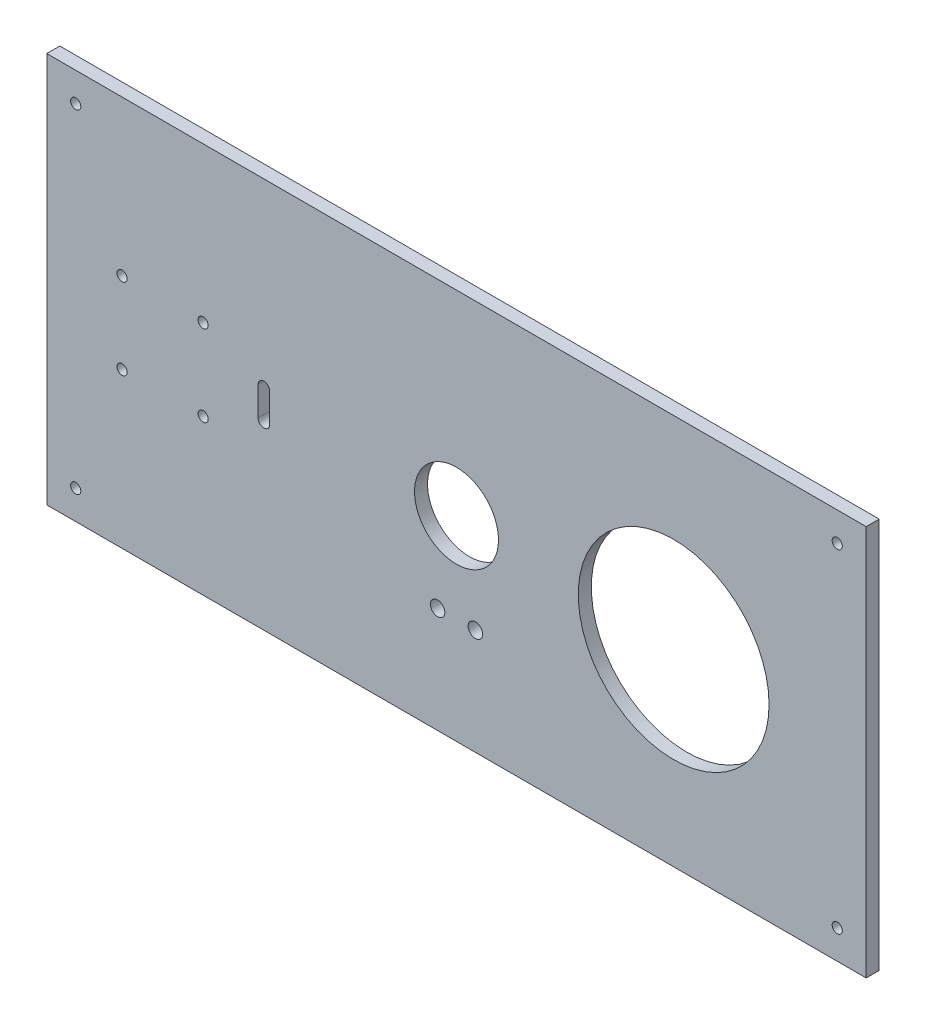
ISO-10303-21;
HEADER;
FILE_DESCRIPTION(('STEP AP214'),'2;1');
FILE_NAME('part.step','',(''),(''),'','','');
FILE_SCHEMA(('AUTOMOTIVE_DESIGN { 1 0 10303 214 1 1 1 1 }'));
ENDSEC;
DATA;
#1=APPLICATION_CONTEXT('core data for automotive mechanical design processes');
#2=APPLICATION_PROTOCOL_DEFINITION('international standard','automotive_design',2000,#1);
#3=PRODUCT_CONTEXT('',#1,'mechanical');
#4=PRODUCT('Part','Part','',(#3));
#5=PRODUCT_RELATED_PRODUCT_CATEGORY('part','',(#4));
#6=PRODUCT_DEFINITION_FORMATION('','',#4);
#7=PRODUCT_DEFINITION_CONTEXT('part definition',#1,'design');
#8=PRODUCT_DEFINITION('design','',#6,#7);
#9=PRODUCT_DEFINITION_SHAPE('','',#8);
#10=(LENGTH_UNIT() NAMED_UNIT(*) SI_UNIT(.MILLI.,.METRE.));
#11=(NAMED_UNIT(*) PLANE_ANGLE_UNIT() SI_UNIT($,.RADIAN.));
#12=(NAMED_UNIT(*) SI_UNIT($,.STERADIAN.) SOLID_ANGLE_UNIT());
#13=UNCERTAINTY_MEASURE_WITH_UNIT(LENGTH_MEASURE(1.E-05),#10,'distance_accuracy_value','');
#14=(GEOMETRIC_REPRESENTATION_CONTEXT(3) GLOBAL_UNCERTAINTY_ASSIGNED_CONTEXT((#13)) GLOBAL_UNIT_ASSIGNED_CONTEXT((#10,
#11,#12)) REPRESENTATION_CONTEXT('',''));
#15=CARTESIAN_POINT('',(0.,0.,0.));
#16=DIRECTION('',(0.,0.,1.));
#17=DIRECTION('',(1.,0.,0.));
#18=AXIS2_PLACEMENT_3D('',#15,#16,#17);
#19=CARTESIAN_POINT('',(-141.5,0.,4.5));
#20=DIRECTION('',(-1.,0.,0.));
#21=DIRECTION('',(0.,0.,1.));
#22=AXIS2_PLACEMENT_3D('',#19,#20,#21);
#23=PLANE('',#22);
#24=DIRECTION('',(0.,1.,0.));
#25=VECTOR('',#24,1.);
#26=CARTESIAN_POINT('',(-141.5,0.,0.));
#27=LINE('',#26,#25);
#28=CARTESIAN_POINT('',(-141.5,-67.5,0.));
#29=VERTEX_POINT('',#28);
#30=CARTESIAN_POINT('',(-141.5,67.5,0.));
#31=VERTEX_POINT('',#30);
#32=EDGE_CURVE('E210',#29,#31,#27,.T.);
#33=ORIENTED_EDGE('',*,*,#32,.F.);
#34=DIRECTION('',(0.,0.,-1.));
#35=VECTOR('',#34,1.);
#36=CARTESIAN_POINT('',(-141.5,-67.5,4.5));
#37=LINE('',#36,#35);
#38=CARTESIAN_POINT('',(-141.5,-67.5,4.5));
#39=VERTEX_POINT('',#38);
#40=EDGE_CURVE('E11',#39,#29,#37,.T.);
#41=ORIENTED_EDGE('',*,*,#40,.F.);
#42=DIRECTION('',(0.,1.,0.));
#43=VECTOR('',#42,1.);
#44=CARTESIAN_POINT('',(-141.5,0.,4.5));
#45=LINE('',#44,#43);
#46=CARTESIAN_POINT('',(-141.5,67.5,4.5));
#47=VERTEX_POINT('',#46);
#48=EDGE_CURVE('E211',#39,#47,#45,.T.);
#49=ORIENTED_EDGE('',*,*,#48,.T.);
#50=DIRECTION('',(0.,0.,-1.));
#51=VECTOR('',#50,1.);
#52=CARTESIAN_POINT('',(-141.5,67.5,4.5));
#53=LINE('',#52,#51);
#54=EDGE_CURVE('E226',#47,#31,#53,.T.);
#55=ORIENTED_EDGE('',*,*,#54,.T.);
#56=EDGE_LOOP('',(#33,#41,#49,#55));
#57=FACE_BOUND('',#56,.T.);
#58=ADVANCED_FACE('F40',(#57),#23,.T.);
#59=CARTESIAN_POINT('',(0.,-67.5,4.5));
#60=DIRECTION('',(0.,-1.,0.));
#61=DIRECTION('',(1.,0.,0.));
#62=AXIS2_PLACEMENT_3D('',#59,#60,#61);
#63=PLANE('',#62);
#64=DIRECTION('',(-1.,0.,0.));
#65=VECTOR('',#64,1.);
#66=CARTESIAN_POINT('',(0.,-67.5,0.));
#67=LINE('',#66,#65);
#68=CARTESIAN_POINT('',(141.5,-67.5,0.));
#69=VERTEX_POINT('',#68);
#70=EDGE_CURVE('E230',#69,#29,#67,.T.);
#71=ORIENTED_EDGE('',*,*,#70,.F.);
#72=DIRECTION('',(0.,0.,-1.));
#73=VECTOR('',#72,1.);
#74=CARTESIAN_POINT('',(141.5,-67.5,4.5));
#75=LINE('',#74,#73);
#76=CARTESIAN_POINT('',(141.5,-67.5,4.5));
#77=VERTEX_POINT('',#76);
#78=EDGE_CURVE('E48',#77,#69,#75,.T.);
#79=ORIENTED_EDGE('',*,*,#78,.F.);
#80=DIRECTION('',(-1.,0.,0.));
#81=VECTOR('',#80,1.);
#82=CARTESIAN_POINT('',(0.,-67.5,4.5));
#83=LINE('',#82,#81);
#84=EDGE_CURVE('E215',#77,#39,#83,.T.);
#85=ORIENTED_EDGE('',*,*,#84,.T.);
#86=ORIENTED_EDGE('',*,*,#40,.T.);
#87=EDGE_LOOP('',(#71,#79,#85,#86));
#88=FACE_BOUND('',#87,.T.);
#89=ADVANCED_FACE('F256',(#88),#63,.T.);
#90=CARTESIAN_POINT('',(141.5,0.,4.5));
#91=DIRECTION('',(-1.,0.,0.));
#92=DIRECTION('',(0.,0.,1.));
#93=AXIS2_PLACEMENT_3D('',#90,#91,#92);
#94=PLANE('',#93);
#95=DIRECTION('',(0.,1.,0.));
#96=VECTOR('',#95,1.);
#97=CARTESIAN_POINT('',(141.5,0.,0.));
#98=LINE('',#97,#96);
#99=CARTESIAN_POINT('',(141.5,67.5,0.));
#100=VERTEX_POINT('',#99);
#101=EDGE_CURVE('E234',#69,#100,#98,.T.);
#102=ORIENTED_EDGE('',*,*,#101,.T.);
#103=DIRECTION('',(0.,0.,-1.));
#104=VECTOR('',#103,1.);
#105=CARTESIAN_POINT('',(141.5,67.5,4.5));
#106=LINE('',#105,#104);
#107=CARTESIAN_POINT('',(141.5,67.5,4.5));
#108=VERTEX_POINT('',#107);
#109=EDGE_CURVE('E242',#108,#100,#106,.T.);
#110=ORIENTED_EDGE('',*,*,#109,.F.);
#111=DIRECTION('',(0.,1.,0.));
#112=VECTOR('',#111,1.);
#113=CARTESIAN_POINT('',(141.5,0.,4.5));
#114=LINE('',#113,#112);
#115=EDGE_CURVE('E220',#77,#108,#114,.T.);
#116=ORIENTED_EDGE('',*,*,#115,.F.);
#117=ORIENTED_EDGE('',*,*,#78,.T.);
#118=EDGE_LOOP('',(#102,#110,#116,#117));
#119=FACE_BOUND('',#118,.T.);
#120=ADVANCED_FACE('F249',(#119),#94,.F.);
#121=CARTESIAN_POINT('',(0.,67.5,4.5));
#122=DIRECTION('',(0.,-1.,0.));
#123=DIRECTION('',(1.,0.,0.));
#124=AXIS2_PLACEMENT_3D('',#121,#122,#123);
#125=PLANE('',#124);
#126=DIRECTION('',(-1.,0.,0.));
#127=VECTOR('',#126,1.);
#128=CARTESIAN_POINT('',(0.,67.5,0.));
#129=LINE('',#128,#127);
#130=EDGE_CURVE('E216',#100,#31,#129,.T.);
#131=ORIENTED_EDGE('',*,*,#130,.T.);
#132=ORIENTED_EDGE('',*,*,#54,.F.);
#133=DIRECTION('',(-1.,0.,0.));
#134=VECTOR('',#133,1.);
#135=CARTESIAN_POINT('',(0.,67.5,4.5));
#136=LINE('',#135,#134);
#137=EDGE_CURVE('E223',#108,#47,#136,.T.);
#138=ORIENTED_EDGE('',*,*,#137,.F.);
#139=ORIENTED_EDGE('',*,*,#109,.T.);
#140=EDGE_LOOP('',(#131,#132,#138,#139));
#141=FACE_BOUND('',#140,.T.);
#142=ADVANCED_FACE('F263',(#141),#125,.F.);
#143=CARTESIAN_POINT('',(0.,0.,4.5));
#144=DIRECTION('',(0.,0.,1.));
#145=DIRECTION('',(1.,0.,0.));
#146=AXIS2_PLACEMENT_3D('',#143,#144,#145);
#147=PLANE('',#146);
#148=CARTESIAN_POINT('',(75.,-2.49999999999997,4.5));
#149=DIRECTION('',(0.,0.,1.));
#150=DIRECTION('',(1.,0.,0.));
#151=AXIS2_PLACEMENT_3D('',#148,#149,#150);
#152=CIRCLE('',#151,32.95);
#153=CARTESIAN_POINT('',(107.95,-2.49999999999997,4.5));
#154=VERTEX_POINT('',#153);
#155=EDGE_CURVE('E461',#154,#154,#152,.T.);
#156=ORIENTED_EDGE('',*,*,#155,.F.);
#157=EDGE_LOOP('',(#156));
#158=FACE_BOUND('',#157,.T.);
#159=CARTESIAN_POINT('',(6.525,-30.95,4.5));
#160=DIRECTION('',(0.,0.,1.));
#161=DIRECTION('',(1.,0.,0.));
#162=AXIS2_PLACEMENT_3D('',#159,#160,#161);
#163=CIRCLE('',#162,2.5);
#164=CARTESIAN_POINT('',(9.025,-30.95,4.5));
#165=VERTEX_POINT('',#164);
#166=EDGE_CURVE('E470',#165,#165,#163,.T.);
#167=ORIENTED_EDGE('',*,*,#166,.F.);
#168=EDGE_LOOP('',(#167));
#169=FACE_BOUND('',#168,.T.);
#170=CARTESIAN_POINT('',(-6.525,-30.95,4.5));
#171=DIRECTION('',(0.,0.,1.));
#172=DIRECTION('',(1.,0.,0.));
#173=AXIS2_PLACEMENT_3D('',#170,#171,#172);
#174=CIRCLE('',#173,2.5);
#175=CARTESIAN_POINT('',(-4.025,-30.95,4.5));
#176=VERTEX_POINT('',#175);
#177=EDGE_CURVE('E478',#176,#176,#174,.T.);
#178=ORIENTED_EDGE('',*,*,#177,.F.);
#179=EDGE_LOOP('',(#178));
#180=FACE_BOUND('',#179,.T.);
#181=CARTESIAN_POINT('',(0.,0.,4.5));
#182=DIRECTION('',(0.,0.,1.));
#183=DIRECTION('',(1.,0.,0.));
#184=AXIS2_PLACEMENT_3D('',#181,#182,#183);
#185=CIRCLE('',#184,14.5);
#186=CARTESIAN_POINT('',(14.5,0.,4.5));
#187=VERTEX_POINT('',#186);
#188=EDGE_CURVE('E479',#187,#187,#185,.T.);
#189=ORIENTED_EDGE('',*,*,#188,.F.);
#190=EDGE_LOOP('',(#189));
#191=FACE_BOUND('',#190,.T.);
#192=CARTESIAN_POINT('',(-87.5,14.,4.5));
#193=DIRECTION('',(0.,0.,1.));
#194=DIRECTION('',(1.,0.,0.));
#195=AXIS2_PLACEMENT_3D('',#192,#193,#194);
#196=CIRCLE('',#195,1.74999999999998);
#197=CARTESIAN_POINT('',(-85.75,14.,4.5));
#198=VERTEX_POINT('',#197);
#199=EDGE_CURVE('E161',#198,#198,#196,.T.);
#200=ORIENTED_EDGE('',*,*,#199,.F.);
#201=EDGE_LOOP('',(#200));
#202=FACE_BOUND('',#201,.T.);
#203=CARTESIAN_POINT('',(-115.5,14.,4.5));
#204=DIRECTION('',(0.,0.,1.));
#205=DIRECTION('',(1.,0.,0.));
#206=AXIS2_PLACEMENT_3D('',#203,#204,#205);
#207=CIRCLE('',#206,1.74999999999997);
#208=CARTESIAN_POINT('',(-113.75,14.,4.5));
#209=VERTEX_POINT('',#208);
#210=EDGE_CURVE('E152',#209,#209,#207,.T.);
#211=ORIENTED_EDGE('',*,*,#210,.F.);
#212=EDGE_LOOP('',(#211));
#213=FACE_BOUND('',#212,.T.);
#214=CARTESIAN_POINT('',(-66.5,-5.00000000000001,4.5));
#215=DIRECTION('',(0.,0.,1.));
#216=DIRECTION('',(1.,0.,0.));
#217=AXIS2_PLACEMENT_3D('',#214,#215,#216);
#218=CIRCLE('',#217,1.99999999999999);
#219=CARTESIAN_POINT('',(-68.5,-5.00000000000001,4.5));
#220=VERTEX_POINT('',#219);
#221=CARTESIAN_POINT('',(-64.5,-5.00000000000001,4.5));
#222=VERTEX_POINT('',#221);
#223=EDGE_CURVE('E55',#220,#222,#218,.T.);
#224=ORIENTED_EDGE('',*,*,#223,.F.);
#225=DIRECTION('',(0.,-1.,0.));
#226=VECTOR('',#225,1.);
#227=CARTESIAN_POINT('',(-68.5,-5.00000000000001,4.5));
#228=LINE('',#227,#226);
#229=CARTESIAN_POINT('',(-68.5,4.99999999999999,4.5));
#230=VERTEX_POINT('',#229);
#231=EDGE_CURVE('E113',#230,#220,#228,.T.);
#232=ORIENTED_EDGE('',*,*,#231,.F.);
#233=CARTESIAN_POINT('',(-66.5,4.99999999999999,4.5));
#234=DIRECTION('',(0.,0.,1.));
#235=DIRECTION('',(1.,0.,0.));
#236=AXIS2_PLACEMENT_3D('',#233,#234,#235);
#237=CIRCLE('',#236,1.99999999999999);
#238=CARTESIAN_POINT('',(-64.5,4.99999999999999,4.5));
#239=VERTEX_POINT('',#238);
#240=EDGE_CURVE('E138',#239,#230,#237,.T.);
#241=ORIENTED_EDGE('',*,*,#240,.F.);
#242=DIRECTION('',(0.,1.,0.));
#243=VECTOR('',#242,1.);
#244=CARTESIAN_POINT('',(-64.5,-5.00000000000001,4.5));
#245=LINE('',#244,#243);
#246=EDGE_CURVE('E131',#222,#239,#245,.T.);
#247=ORIENTED_EDGE('',*,*,#246,.F.);
#248=EDGE_LOOP('',(#224,#232,#241,#247));
#249=FACE_BOUND('',#248,.T.);
#250=CARTESIAN_POINT('',(-115.5,-14.,4.5));
#251=DIRECTION('',(0.,0.,1.));
#252=DIRECTION('',(1.,0.,0.));
#253=AXIS2_PLACEMENT_3D('',#250,#251,#252);
#254=CIRCLE('',#253,1.74999999999998);
#255=CARTESIAN_POINT('',(-113.75,-14.,4.5));
#256=VERTEX_POINT('',#255);
#257=EDGE_CURVE('E120',#256,#256,#254,.T.);
#258=ORIENTED_EDGE('',*,*,#257,.F.);
#259=EDGE_LOOP('',(#258));
#260=FACE_BOUND('',#259,.T.);
#261=CARTESIAN_POINT('',(-87.5,-14.,4.5));
#262=DIRECTION('',(0.,0.,1.));
#263=DIRECTION('',(1.,0.,0.));
#264=AXIS2_PLACEMENT_3D('',#261,#262,#263);
#265=CIRCLE('',#264,1.74999999999991);
#266=CARTESIAN_POINT('',(-85.7500000000001,-14.,4.5));
#267=VERTEX_POINT('',#266);
#268=EDGE_CURVE('E169',#267,#267,#265,.T.);
#269=ORIENTED_EDGE('',*,*,#268,.F.);
#270=EDGE_LOOP('',(#269));
#271=FACE_BOUND('',#270,.T.);
#272=CARTESIAN_POINT('',(131.5,57.5,4.5));
#273=DIRECTION('',(0.,0.,1.));
#274=DIRECTION('',(1.,0.,0.));
#275=AXIS2_PLACEMENT_3D('',#272,#273,#274);
#276=CIRCLE('',#275,1.75000000000001);
#277=CARTESIAN_POINT('',(133.25,57.5,4.5));
#278=VERTEX_POINT('',#277);
#279=EDGE_CURVE('E178',#278,#278,#276,.F.);
#280=ORIENTED_EDGE('',*,*,#279,.T.);
#281=EDGE_LOOP('',(#280));
#282=FACE_BOUND('',#281,.T.);
#283=CARTESIAN_POINT('',(131.5,-57.5,4.5));
#284=DIRECTION('',(0.,0.,1.));
#285=DIRECTION('',(1.,0.,0.));
#286=AXIS2_PLACEMENT_3D('',#283,#284,#285);
#287=CIRCLE('',#286,1.75000000000001);
#288=CARTESIAN_POINT('',(133.25,-57.5,4.5));
#289=VERTEX_POINT('',#288);
#290=EDGE_CURVE('E190',#289,#289,#287,.T.);
#291=ORIENTED_EDGE('',*,*,#290,.F.);
#292=EDGE_LOOP('',(#291));
#293=FACE_BOUND('',#292,.T.);
#294=CARTESIAN_POINT('',(-131.5,-57.5,4.5));
#295=DIRECTION('',(0.,0.,1.));
#296=DIRECTION('',(1.,0.,0.));
#297=AXIS2_PLACEMENT_3D('',#294,#295,#296);
#298=CIRCLE('',#297,1.75000000000001);
#299=CARTESIAN_POINT('',(-129.75,-57.5,4.5));
#300=VERTEX_POINT('',#299);
#301=EDGE_CURVE('E194',#300,#300,#298,.F.);
#302=ORIENTED_EDGE('',*,*,#301,.T.);
#303=EDGE_LOOP('',(#302));
#304=FACE_BOUND('',#303,.T.);
#305=CARTESIAN_POINT('',(-131.5,57.5,4.5));
#306=DIRECTION('',(0.,0.,1.));
#307=DIRECTION('',(1.,0.,0.));
#308=AXIS2_PLACEMENT_3D('',#305,#306,#307);
#309=CIRCLE('',#308,1.75000000000001);
#310=CARTESIAN_POINT('',(-129.75,57.5,4.5));
#311=VERTEX_POINT('',#310);
#312=EDGE_CURVE('E206',#311,#311,#309,.T.);
#313=ORIENTED_EDGE('',*,*,#312,.F.);
#314=EDGE_LOOP('',(#313));
#315=FACE_BOUND('',#314,.T.);
#316=ORIENTED_EDGE('',*,*,#48,.F.);
#317=ORIENTED_EDGE('',*,*,#84,.F.);
#318=ORIENTED_EDGE('',*,*,#115,.T.);
#319=ORIENTED_EDGE('',*,*,#137,.T.);
#320=EDGE_LOOP('',(#316,#317,#318,#319));
#321=FACE_BOUND('',#320,.T.);
#322=ADVANCED_FACE('F265',(#158,#169,#180,#191,#202,#213,#249,#260,#271,#282,#293,#304,#315,
#321),#147,.T.);
#323=CARTESIAN_POINT('',(0.,0.,0.));
#324=DIRECTION('',(0.,0.,1.));
#325=DIRECTION('',(1.,0.,0.));
#326=AXIS2_PLACEMENT_3D('',#323,#324,#325);
#327=PLANE('',#326);
#328=CARTESIAN_POINT('',(75.,-2.49999999999997,0.));
#329=DIRECTION('',(0.,0.,1.));
#330=DIRECTION('',(1.,0.,0.));
#331=AXIS2_PLACEMENT_3D('',#328,#329,#330);
#332=CIRCLE('',#331,32.95);
#333=CARTESIAN_POINT('',(107.95,-2.49999999999997,0.));
#334=VERTEX_POINT('',#333);
#335=EDGE_CURVE('E165',#334,#334,#332,.F.);
#336=ORIENTED_EDGE('',*,*,#335,.F.);
#337=EDGE_LOOP('',(#336));
#338=FACE_BOUND('',#337,.T.);
#339=CARTESIAN_POINT('',(6.525,-30.95,0.));
#340=DIRECTION('',(0.,0.,1.));
#341=DIRECTION('',(1.,0.,0.));
#342=AXIS2_PLACEMENT_3D('',#339,#340,#341);
#343=CIRCLE('',#342,2.5);
#344=CARTESIAN_POINT('',(9.025,-30.95,0.));
#345=VERTEX_POINT('',#344);
#346=EDGE_CURVE('E474',#345,#345,#343,.F.);
#347=ORIENTED_EDGE('',*,*,#346,.F.);
#348=EDGE_LOOP('',(#347));
#349=FACE_BOUND('',#348,.T.);
#350=CARTESIAN_POINT('',(-6.525,-30.95,0.));
#351=DIRECTION('',(0.,0.,1.));
#352=DIRECTION('',(1.,0.,0.));
#353=AXIS2_PLACEMENT_3D('',#350,#351,#352);
#354=CIRCLE('',#353,2.5);
#355=CARTESIAN_POINT('',(-4.025,-30.95,0.));
#356=VERTEX_POINT('',#355);
#357=EDGE_CURVE('E483',#356,#356,#354,.F.);
#358=ORIENTED_EDGE('',*,*,#357,.F.);
#359=EDGE_LOOP('',(#358));
#360=FACE_BOUND('',#359,.T.);
#361=CARTESIAN_POINT('',(0.,0.,0.));
#362=DIRECTION('',(0.,0.,1.));
#363=DIRECTION('',(1.,0.,0.));
#364=AXIS2_PLACEMENT_3D('',#361,#362,#363);
#365=CIRCLE('',#364,14.5);
#366=CARTESIAN_POINT('',(14.5,0.,0.));
#367=VERTEX_POINT('',#366);
#368=EDGE_CURVE('E467',#367,#367,#365,.F.);
#369=ORIENTED_EDGE('',*,*,#368,.F.);
#370=EDGE_LOOP('',(#369));
#371=FACE_BOUND('',#370,.T.);
#372=CARTESIAN_POINT('',(-87.5,14.,0.));
#373=DIRECTION('',(0.,0.,1.));
#374=DIRECTION('',(1.,0.,0.));
#375=AXIS2_PLACEMENT_3D('',#372,#373,#374);
#376=CIRCLE('',#375,1.74999999999998);
#377=CARTESIAN_POINT('',(-85.75,14.,0.));
#378=VERTEX_POINT('',#377);
#379=EDGE_CURVE('E157',#378,#378,#376,.F.);
#380=ORIENTED_EDGE('',*,*,#379,.F.);
#381=EDGE_LOOP('',(#380));
#382=FACE_BOUND('',#381,.T.);
#383=CARTESIAN_POINT('',(-115.5,14.,0.));
#384=DIRECTION('',(0.,0.,1.));
#385=DIRECTION('',(1.,0.,0.));
#386=AXIS2_PLACEMENT_3D('',#383,#384,#385);
#387=CIRCLE('',#386,1.74999999999997);
#388=CARTESIAN_POINT('',(-113.75,14.,0.));
#389=VERTEX_POINT('',#388);
#390=EDGE_CURVE('E156',#389,#389,#387,.F.);
#391=ORIENTED_EDGE('',*,*,#390,.F.);
#392=EDGE_LOOP('',(#391));
#393=FACE_BOUND('',#392,.T.);
#394=DIRECTION('',(0.,1.,0.));
#395=VECTOR('',#394,1.);
#396=CARTESIAN_POINT('',(-68.5,-5.00000000000001,0.));
#397=LINE('',#396,#395);
#398=CARTESIAN_POINT('',(-68.5,-5.00000000000001,0.));
#399=VERTEX_POINT('',#398);
#400=CARTESIAN_POINT('',(-68.5,4.99999999999999,0.));
#401=VERTEX_POINT('',#400);
#402=EDGE_CURVE('E126',#399,#401,#397,.T.);
#403=ORIENTED_EDGE('',*,*,#402,.F.);
#404=CARTESIAN_POINT('',(-66.5,-5.00000000000001,0.));
#405=DIRECTION('',(0.,0.,1.));
#406=DIRECTION('',(1.,0.,0.));
#407=AXIS2_PLACEMENT_3D('',#404,#405,#406);
#408=CIRCLE('',#407,1.99999999999999);
#409=CARTESIAN_POINT('',(-64.5,-5.00000000000001,0.));
#410=VERTEX_POINT('',#409);
#411=EDGE_CURVE('E106',#410,#399,#408,.F.);
#412=ORIENTED_EDGE('',*,*,#411,.F.);
#413=DIRECTION('',(0.,-1.,0.));
#414=VECTOR('',#413,1.);
#415=CARTESIAN_POINT('',(-64.5,-5.00000000000001,0.));
#416=LINE('',#415,#414);
#417=CARTESIAN_POINT('',(-64.5,4.99999999999999,0.));
#418=VERTEX_POINT('',#417);
#419=EDGE_CURVE('E116',#418,#410,#416,.T.);
#420=ORIENTED_EDGE('',*,*,#419,.F.);
#421=CARTESIAN_POINT('',(-66.5,4.99999999999999,0.));
#422=DIRECTION('',(0.,0.,1.));
#423=DIRECTION('',(1.,0.,0.));
#424=AXIS2_PLACEMENT_3D('',#421,#422,#423);
#425=CIRCLE('',#424,1.99999999999999);
#426=EDGE_CURVE('E63',#401,#418,#425,.F.);
#427=ORIENTED_EDGE('',*,*,#426,.F.);
#428=EDGE_LOOP('',(#403,#412,#420,#427));
#429=FACE_BOUND('',#428,.T.);
#430=CARTESIAN_POINT('',(-115.5,-14.,0.));
#431=DIRECTION('',(0.,0.,1.));
#432=DIRECTION('',(1.,0.,0.));
#433=AXIS2_PLACEMENT_3D('',#430,#431,#432);
#434=CIRCLE('',#433,1.74999999999998);
#435=CARTESIAN_POINT('',(-113.75,-14.,0.));
#436=VERTEX_POINT('',#435);
#437=EDGE_CURVE('E174',#436,#436,#434,.F.);
#438=ORIENTED_EDGE('',*,*,#437,.F.);
#439=EDGE_LOOP('',(#438));
#440=FACE_BOUND('',#439,.T.);
#441=CARTESIAN_POINT('',(-87.5,-14.,0.));
#442=DIRECTION('',(0.,0.,1.));
#443=DIRECTION('',(1.,0.,0.));
#444=AXIS2_PLACEMENT_3D('',#441,#442,#443);
#445=CIRCLE('',#444,1.74999999999991);
#446=CARTESIAN_POINT('',(-85.7500000000001,-14.,0.));
#447=VERTEX_POINT('',#446);
#448=EDGE_CURVE('E173',#447,#447,#445,.F.);
#449=ORIENTED_EDGE('',*,*,#448,.F.);
#450=EDGE_LOOP('',(#449));
#451=FACE_BOUND('',#450,.T.);
#452=CARTESIAN_POINT('',(131.5,57.5,0.));
#453=DIRECTION('',(0.,0.,-1.));
#454=DIRECTION('',(-1.,0.,0.));
#455=AXIS2_PLACEMENT_3D('',#452,#453,#454);
#456=CIRCLE('',#455,1.75000000000001);
#457=CARTESIAN_POINT('',(129.75,57.5,0.));
#458=VERTEX_POINT('',#457);
#459=EDGE_CURVE('E179',#458,#458,#456,.T.);
#460=ORIENTED_EDGE('',*,*,#459,.F.);
#461=EDGE_LOOP('',(#460));
#462=FACE_BOUND('',#461,.T.);
#463=CARTESIAN_POINT('',(131.5,-57.5,0.));
#464=DIRECTION('',(0.,0.,1.));
#465=DIRECTION('',(-1.,0.,0.));
#466=AXIS2_PLACEMENT_3D('',#463,#464,#465);
#467=CIRCLE('',#466,1.75000000000001);
#468=CARTESIAN_POINT('',(129.75,-57.5,0.));
#469=VERTEX_POINT('',#468);
#470=EDGE_CURVE('E183',#469,#469,#467,.T.);
#471=ORIENTED_EDGE('',*,*,#470,.T.);
#472=EDGE_LOOP('',(#471));
#473=FACE_BOUND('',#472,.T.);
#474=CARTESIAN_POINT('',(-131.5,-57.5,0.));
#475=DIRECTION('',(0.,0.,-1.));
#476=DIRECTION('',(1.,0.,0.));
#477=AXIS2_PLACEMENT_3D('',#474,#475,#476);
#478=CIRCLE('',#477,1.75000000000001);
#479=CARTESIAN_POINT('',(-129.75,-57.5,0.));
#480=VERTEX_POINT('',#479);
#481=EDGE_CURVE('E195',#480,#480,#478,.T.);
#482=ORIENTED_EDGE('',*,*,#481,.F.);
#483=EDGE_LOOP('',(#482));
#484=FACE_BOUND('',#483,.T.);
#485=CARTESIAN_POINT('',(-131.5,57.5,0.));
#486=DIRECTION('',(0.,0.,1.));
#487=DIRECTION('',(1.,0.,0.));
#488=AXIS2_PLACEMENT_3D('',#485,#486,#487);
#489=CIRCLE('',#488,1.75000000000001);
#490=CARTESIAN_POINT('',(-129.75,57.5,0.));
#491=VERTEX_POINT('',#490);
#492=EDGE_CURVE('E199',#491,#491,#489,.T.);
#493=ORIENTED_EDGE('',*,*,#492,.T.);
#494=EDGE_LOOP('',(#493));
#495=FACE_BOUND('',#494,.T.);
#496=ORIENTED_EDGE('',*,*,#32,.T.);
#497=ORIENTED_EDGE('',*,*,#130,.F.);
#498=ORIENTED_EDGE('',*,*,#101,.F.);
#499=ORIENTED_EDGE('',*,*,#70,.T.);
#500=EDGE_LOOP('',(#496,#497,#498,#499));
#501=FACE_BOUND('',#500,.T.);
#502=ADVANCED_FACE('F123',(#338,#349,#360,#371,#382,#393,#429,#440,#451,#462,#473,#484,#495,
#501),#327,.F.);
#503=CARTESIAN_POINT('',(-131.5,57.5,4.501));
#504=DIRECTION('',(0.,0.,-1.));
#505=DIRECTION('',(-1.,0.,0.));
#506=AXIS2_PLACEMENT_3D('',#503,#504,#505);
#507=CYLINDRICAL_SURFACE('',#506,1.75000000000001);
#508=ORIENTED_EDGE('',*,*,#312,.T.);
#509=EDGE_LOOP('',(#508));
#510=FACE_BOUND('',#509,.T.);
#511=ORIENTED_EDGE('',*,*,#492,.F.);
#512=EDGE_LOOP('',(#511));
#513=FACE_BOUND('',#512,.T.);
#514=ADVANCED_FACE('F273',(#510,#513),#507,.F.);
#515=CARTESIAN_POINT('',(-131.5,-57.5,4.501));
#516=DIRECTION('',(0.,0.,-1.));
#517=DIRECTION('',(-1.,0.,0.));
#518=AXIS2_PLACEMENT_3D('',#515,#516,#517);
#519=CYLINDRICAL_SURFACE('',#518,1.75000000000001);
#520=ORIENTED_EDGE('',*,*,#301,.F.);
#521=EDGE_LOOP('',(#520));
#522=FACE_BOUND('',#521,.T.);
#523=ORIENTED_EDGE('',*,*,#481,.T.);
#524=EDGE_LOOP('',(#523));
#525=FACE_BOUND('',#524,.T.);
#526=ADVANCED_FACE('F313',(#522,#525),#519,.F.);
#527=CARTESIAN_POINT('',(131.5,-57.5,4.501));
#528=DIRECTION('',(0.,0.,-1.));
#529=DIRECTION('',(-1.,0.,0.));
#530=AXIS2_PLACEMENT_3D('',#527,#528,#529);
#531=CYLINDRICAL_SURFACE('',#530,1.75000000000001);
#532=ORIENTED_EDGE('',*,*,#290,.T.);
#533=EDGE_LOOP('',(#532));
#534=FACE_BOUND('',#533,.T.);
#535=ORIENTED_EDGE('',*,*,#470,.F.);
#536=EDGE_LOOP('',(#535));
#537=FACE_BOUND('',#536,.T.);
#538=ADVANCED_FACE('F319',(#534,#537),#531,.F.);
#539=CARTESIAN_POINT('',(131.5,57.5,4.501));
#540=DIRECTION('',(0.,0.,-1.));
#541=DIRECTION('',(-1.,0.,0.));
#542=AXIS2_PLACEMENT_3D('',#539,#540,#541);
#543=CYLINDRICAL_SURFACE('',#542,1.75000000000001);
#544=ORIENTED_EDGE('',*,*,#279,.F.);
#545=EDGE_LOOP('',(#544));
#546=FACE_BOUND('',#545,.T.);
#547=ORIENTED_EDGE('',*,*,#459,.T.);
#548=EDGE_LOOP('',(#547));
#549=FACE_BOUND('',#548,.T.);
#550=ADVANCED_FACE('F327',(#546,#549),#543,.F.);
#551=CARTESIAN_POINT('',(-87.5,-14.,-0.00100000000000013));
#552=DIRECTION('',(0.,0.,1.));
#553=DIRECTION('',(1.,0.,0.));
#554=AXIS2_PLACEMENT_3D('',#551,#552,#553);
#555=CYLINDRICAL_SURFACE('',#554,1.74999999999991);
#556=ORIENTED_EDGE('',*,*,#268,.T.);
#557=EDGE_LOOP('',(#556));
#558=FACE_BOUND('',#557,.T.);
#559=ORIENTED_EDGE('',*,*,#448,.T.);
#560=EDGE_LOOP('',(#559));
#561=FACE_BOUND('',#560,.T.);
#562=ADVANCED_FACE('F335',(#558,#561),#555,.F.);
#563=CARTESIAN_POINT('',(-115.5,-14.,-0.00100000000000013));
#564=DIRECTION('',(0.,0.,1.));
#565=DIRECTION('',(1.,0.,0.));
#566=AXIS2_PLACEMENT_3D('',#563,#564,#565);
#567=CYLINDRICAL_SURFACE('',#566,1.74999999999998);
#568=ORIENTED_EDGE('',*,*,#257,.T.);
#569=EDGE_LOOP('',(#568));
#570=FACE_BOUND('',#569,.T.);
#571=ORIENTED_EDGE('',*,*,#437,.T.);
#572=EDGE_LOOP('',(#571));
#573=FACE_BOUND('',#572,.T.);
#574=ADVANCED_FACE('F343',(#570,#573),#567,.F.);
#575=CARTESIAN_POINT('',(-66.5,-5.00000000000001,-0.00100000000000013));
#576=DIRECTION('',(0.,0.,1.));
#577=DIRECTION('',(1.,0.,0.));
#578=AXIS2_PLACEMENT_3D('',#575,#576,#577);
#579=CYLINDRICAL_SURFACE('',#578,1.99999999999999);
#580=ORIENTED_EDGE('',*,*,#411,.T.);
#581=DIRECTION('',(0.,0.,1.));
#582=VECTOR('',#581,1.);
#583=CARTESIAN_POINT('',(-68.5,-5.00000000000001,-0.00100000000000013));
#584=LINE('',#583,#582);
#585=EDGE_CURVE('E121',#399,#220,#584,.T.);
#586=ORIENTED_EDGE('',*,*,#585,.T.);
#587=ORIENTED_EDGE('',*,*,#223,.T.);
#588=DIRECTION('',(0.,0.,1.));
#589=VECTOR('',#588,1.);
#590=CARTESIAN_POINT('',(-64.5,-5.00000000000001,-0.00100000000000013));
#591=LINE('',#590,#589);
#592=EDGE_CURVE('E102',#410,#222,#591,.T.);
#593=ORIENTED_EDGE('',*,*,#592,.F.);
#594=EDGE_LOOP('',(#580,#586,#587,#593));
#595=FACE_BOUND('',#594,.T.);
#596=ADVANCED_FACE('F104',(#595),#579,.F.);
#597=CARTESIAN_POINT('',(-68.5,-5.00000000000001,-0.00100000000000013));
#598=DIRECTION('',(-1.,0.,0.));
#599=DIRECTION('',(0.,0.,1.));
#600=AXIS2_PLACEMENT_3D('',#597,#598,#599);
#601=PLANE('',#600);
#602=ORIENTED_EDGE('',*,*,#402,.T.);
#603=DIRECTION('',(0.,0.,1.));
#604=VECTOR('',#603,1.);
#605=CARTESIAN_POINT('',(-68.5,4.99999999999999,-0.00100000000000013));
#606=LINE('',#605,#604);
#607=EDGE_CURVE('E147',#401,#230,#606,.T.);
#608=ORIENTED_EDGE('',*,*,#607,.T.);
#609=ORIENTED_EDGE('',*,*,#231,.T.);
#610=ORIENTED_EDGE('',*,*,#585,.F.);
#611=EDGE_LOOP('',(#602,#608,#609,#610));
#612=FACE_BOUND('',#611,.T.);
#613=ADVANCED_FACE('F358',(#612),#601,.F.);
#614=CARTESIAN_POINT('',(-66.5,4.99999999999999,-0.00100000000000013));
#615=DIRECTION('',(0.,0.,1.));
#616=DIRECTION('',(1.,0.,0.));
#617=AXIS2_PLACEMENT_3D('',#614,#615,#616);
#618=CYLINDRICAL_SURFACE('',#617,1.99999999999999);
#619=ORIENTED_EDGE('',*,*,#426,.T.);
#620=DIRECTION('',(0.,0.,1.));
#621=VECTOR('',#620,1.);
#622=CARTESIAN_POINT('',(-64.5,4.99999999999999,-0.00100000000000013));
#623=LINE('',#622,#621);
#624=EDGE_CURVE('E112',#418,#239,#623,.T.);
#625=ORIENTED_EDGE('',*,*,#624,.T.);
#626=ORIENTED_EDGE('',*,*,#240,.T.);
#627=ORIENTED_EDGE('',*,*,#607,.F.);
#628=EDGE_LOOP('',(#619,#625,#626,#627));
#629=FACE_BOUND('',#628,.T.);
#630=ADVANCED_FACE('F365',(#629),#618,.F.);
#631=CARTESIAN_POINT('',(-64.5,-5.00000000000001,-0.00100000000000013));
#632=DIRECTION('',(1.,0.,0.));
#633=DIRECTION('',(0.,0.,-1.));
#634=AXIS2_PLACEMENT_3D('',#631,#632,#633);
#635=PLANE('',#634);
#636=ORIENTED_EDGE('',*,*,#419,.T.);
#637=ORIENTED_EDGE('',*,*,#592,.T.);
#638=ORIENTED_EDGE('',*,*,#246,.T.);
#639=ORIENTED_EDGE('',*,*,#624,.F.);
#640=EDGE_LOOP('',(#636,#637,#638,#639));
#641=FACE_BOUND('',#640,.T.);
#642=ADVANCED_FACE('F117',(#641),#635,.F.);
#643=CARTESIAN_POINT('',(-115.5,14.,-0.00100000000000013));
#644=DIRECTION('',(0.,0.,1.));
#645=DIRECTION('',(1.,0.,0.));
#646=AXIS2_PLACEMENT_3D('',#643,#644,#645);
#647=CYLINDRICAL_SURFACE('',#646,1.74999999999997);
#648=ORIENTED_EDGE('',*,*,#210,.T.);
#649=EDGE_LOOP('',(#648));
#650=FACE_BOUND('',#649,.T.);
#651=ORIENTED_EDGE('',*,*,#390,.T.);
#652=EDGE_LOOP('',(#651));
#653=FACE_BOUND('',#652,.T.);
#654=ADVANCED_FACE('F379',(#650,#653),#647,.F.);
#655=CARTESIAN_POINT('',(-87.5,14.,-0.00100000000000013));
#656=DIRECTION('',(0.,0.,1.));
#657=DIRECTION('',(1.,0.,0.));
#658=AXIS2_PLACEMENT_3D('',#655,#656,#657);
#659=CYLINDRICAL_SURFACE('',#658,1.74999999999998);
#660=ORIENTED_EDGE('',*,*,#199,.T.);
#661=EDGE_LOOP('',(#660));
#662=FACE_BOUND('',#661,.T.);
#663=ORIENTED_EDGE('',*,*,#379,.T.);
#664=EDGE_LOOP('',(#663));
#665=FACE_BOUND('',#664,.T.);
#666=ADVANCED_FACE('F386',(#662,#665),#659,.F.);
#667=CARTESIAN_POINT('',(0.,0.,-0.00100000000000013));
#668=DIRECTION('',(0.,0.,1.));
#669=DIRECTION('',(1.,0.,0.));
#670=AXIS2_PLACEMENT_3D('',#667,#668,#669);
#671=CYLINDRICAL_SURFACE('',#670,14.5);
#672=ORIENTED_EDGE('',*,*,#188,.T.);
#673=EDGE_LOOP('',(#672));
#674=FACE_BOUND('',#673,.T.);
#675=ORIENTED_EDGE('',*,*,#368,.T.);
#676=EDGE_LOOP('',(#675));
#677=FACE_BOUND('',#676,.T.);
#678=ADVANCED_FACE('F393',(#674,#677),#671,.F.);
#679=CARTESIAN_POINT('',(-6.525,-30.95,-0.00100000000000013));
#680=DIRECTION('',(0.,0.,1.));
#681=DIRECTION('',(1.,0.,0.));
#682=AXIS2_PLACEMENT_3D('',#679,#680,#681);
#683=CYLINDRICAL_SURFACE('',#682,2.5);
#684=ORIENTED_EDGE('',*,*,#177,.T.);
#685=EDGE_LOOP('',(#684));
#686=FACE_BOUND('',#685,.T.);
#687=ORIENTED_EDGE('',*,*,#357,.T.);
#688=EDGE_LOOP('',(#687));
#689=FACE_BOUND('',#688,.T.);
#690=ADVANCED_FACE('F400',(#686,#689),#683,.F.);
#691=CARTESIAN_POINT('',(6.525,-30.95,-0.00100000000000013));
#692=DIRECTION('',(0.,0.,1.));
#693=DIRECTION('',(1.,0.,0.));
#694=AXIS2_PLACEMENT_3D('',#691,#692,#693);
#695=CYLINDRICAL_SURFACE('',#694,2.5);
#696=ORIENTED_EDGE('',*,*,#166,.T.);
#697=EDGE_LOOP('',(#696));
#698=FACE_BOUND('',#697,.T.);
#699=ORIENTED_EDGE('',*,*,#346,.T.);
#700=EDGE_LOOP('',(#699));
#701=FACE_BOUND('',#700,.T.);
#702=ADVANCED_FACE('F408',(#698,#701),#695,.F.);
#703=CARTESIAN_POINT('',(75.,-2.49999999999997,-0.00100000000000013));
#704=DIRECTION('',(0.,0.,1.));
#705=DIRECTION('',(1.,0.,0.));
#706=AXIS2_PLACEMENT_3D('',#703,#704,#705);
#707=CYLINDRICAL_SURFACE('',#706,32.95);
#708=ORIENTED_EDGE('',*,*,#155,.T.);
#709=EDGE_LOOP('',(#708));
#710=FACE_BOUND('',#709,.T.);
#711=ORIENTED_EDGE('',*,*,#335,.T.);
#712=EDGE_LOOP('',(#711));
#713=FACE_BOUND('',#712,.T.);
#714=ADVANCED_FACE('F416',(#710,#713),#707,.F.);
#715=CLOSED_SHELL('',(#58,#89,#120,#142,#322,#502,#514,#526,#538,#550,#562,#574,#596,#613,#630,
#642,#654,#666,#678,#690,#702,#714));
#716=MANIFOLD_SOLID_BREP('B2',#715);
#717=ADVANCED_BREP_SHAPE_REPRESENTATION('',(#18,#716),#14);
#718=SHAPE_DEFINITION_REPRESENTATION(#9,#717);
ENDSEC;
END-ISO-10303-21;
